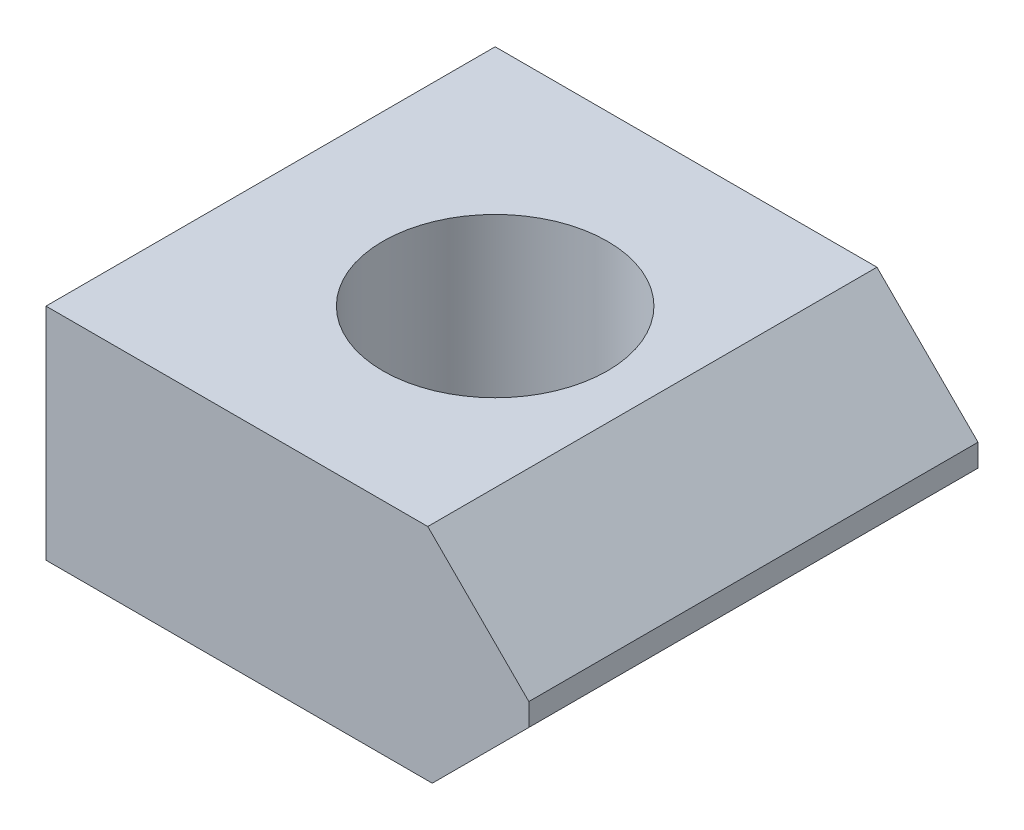
ISO-10303-21;
HEADER;
FILE_DESCRIPTION(('STEP AP214'),'2;1');
FILE_NAME('part.step','',(''),(''),'','','');
FILE_SCHEMA(('AUTOMOTIVE_DESIGN { 1 0 10303 214 1 1 1 1 }'));
ENDSEC;
DATA;
#1=APPLICATION_CONTEXT('core data for automotive mechanical design processes');
#2=APPLICATION_PROTOCOL_DEFINITION('international standard','automotive_design',2000,#1);
#3=PRODUCT_CONTEXT('',#1,'mechanical');
#4=PRODUCT('Part','Part','',(#3));
#5=PRODUCT_RELATED_PRODUCT_CATEGORY('part','',(#4));
#6=PRODUCT_DEFINITION_FORMATION('','',#4);
#7=PRODUCT_DEFINITION_CONTEXT('part definition',#1,'design');
#8=PRODUCT_DEFINITION('design','',#6,#7);
#9=PRODUCT_DEFINITION_SHAPE('','',#8);
#10=(LENGTH_UNIT() NAMED_UNIT(*) SI_UNIT(.MILLI.,.METRE.));
#11=(NAMED_UNIT(*) PLANE_ANGLE_UNIT() SI_UNIT($,.RADIAN.));
#12=(NAMED_UNIT(*) SI_UNIT($,.STERADIAN.) SOLID_ANGLE_UNIT());
#13=UNCERTAINTY_MEASURE_WITH_UNIT(LENGTH_MEASURE(1.E-05),#10,'distance_accuracy_value','');
#14=(GEOMETRIC_REPRESENTATION_CONTEXT(3) GLOBAL_UNCERTAINTY_ASSIGNED_CONTEXT((#13)) GLOBAL_UNIT_ASSIGNED_CONTEXT((#10,
#11,#12)) REPRESENTATION_CONTEXT('',''));
#15=CARTESIAN_POINT('',(0.,0.,0.));
#16=DIRECTION('',(0.,0.,1.));
#17=DIRECTION('',(1.,0.,0.));
#18=AXIS2_PLACEMENT_3D('',#15,#16,#17);
#19=CARTESIAN_POINT('',(17.,15.5,0.));
#20=DIRECTION('',(0.707106781186548,0.707106781186548,0.));
#21=DIRECTION('',(-0.707106781186548,0.707106781186548,0.));
#22=AXIS2_PLACEMENT_3D('',#19,#20,#21);
#23=PLANE('',#22);
#24=DIRECTION('',(0.,0.,-1.));
#25=VECTOR('',#24,1.);
#26=CARTESIAN_POINT('',(21.5,11.,20.));
#27=LINE('',#26,#25);
#28=CARTESIAN_POINT('',(21.5,11.,-20.));
#29=VERTEX_POINT('',#28);
#30=CARTESIAN_POINT('',(21.5,11.,20.));
#31=VERTEX_POINT('',#30);
#32=EDGE_CURVE('E73',#29,#31,#27,.F.);
#33=ORIENTED_EDGE('',*,*,#32,.F.);
#34=DIRECTION('',(0.707106781186547,-0.707106781186547,0.));
#35=VECTOR('',#34,1.);
#36=CARTESIAN_POINT('',(12.5,20.,-20.));
#37=LINE('',#36,#35);
#38=CARTESIAN_POINT('',(12.5,20.,-20.));
#39=VERTEX_POINT('',#38);
#40=EDGE_CURVE('E104',#39,#29,#37,.T.);
#41=ORIENTED_EDGE('',*,*,#40,.F.);
#42=DIRECTION('',(0.,0.,1.));
#43=VECTOR('',#42,1.);
#44=CARTESIAN_POINT('',(12.5,20.,0.));
#45=LINE('',#44,#43);
#46=CARTESIAN_POINT('',(12.5,20.,20.));
#47=VERTEX_POINT('',#46);
#48=EDGE_CURVE('E81',#47,#39,#45,.F.);
#49=ORIENTED_EDGE('',*,*,#48,.F.);
#50=DIRECTION('',(-0.707106781186547,0.707106781186547,0.));
#51=VECTOR('',#50,1.);
#52=CARTESIAN_POINT('',(21.5,11.,20.));
#53=LINE('',#52,#51);
#54=EDGE_CURVE('E66',#31,#47,#53,.T.);
#55=ORIENTED_EDGE('',*,*,#54,.F.);
#56=EDGE_LOOP('',(#33,#41,#49,#55));
#57=FACE_BOUND('',#56,.T.);
#58=ADVANCED_FACE('F17',(#57),#23,.T.);
#59=CARTESIAN_POINT('',(21.5,0.,20.));
#60=DIRECTION('',(1.,0.,0.));
#61=DIRECTION('',(0.,0.,-1.));
#62=AXIS2_PLACEMENT_3D('',#59,#60,#61);
#63=PLANE('',#62);
#64=DIRECTION('',(0.,1.,0.));
#65=VECTOR('',#64,1.);
#66=CARTESIAN_POINT('',(21.5,0.,-20.));
#67=LINE('',#66,#65);
#68=CARTESIAN_POINT('',(21.5,9.,-20.));
#69=VERTEX_POINT('',#68);
#70=EDGE_CURVE('E78',#29,#69,#67,.F.);
#71=ORIENTED_EDGE('',*,*,#70,.F.);
#72=ORIENTED_EDGE('',*,*,#32,.T.);
#73=DIRECTION('',(0.,1.,0.));
#74=VECTOR('',#73,1.);
#75=CARTESIAN_POINT('',(21.5,0.,20.));
#76=LINE('',#75,#74);
#77=CARTESIAN_POINT('',(21.5,9.,20.));
#78=VERTEX_POINT('',#77);
#79=EDGE_CURVE('E76',#78,#31,#76,.T.);
#80=ORIENTED_EDGE('',*,*,#79,.F.);
#81=DIRECTION('',(0.,0.,1.));
#82=VECTOR('',#81,1.);
#83=CARTESIAN_POINT('',(21.5,9.,0.));
#84=LINE('',#83,#82);
#85=EDGE_CURVE('E114',#69,#78,#84,.T.);
#86=ORIENTED_EDGE('',*,*,#85,.F.);
#87=EDGE_LOOP('',(#71,#72,#80,#86));
#88=FACE_BOUND('',#87,.T.);
#89=ADVANCED_FACE('F74',(#88),#63,.T.);
#90=CARTESIAN_POINT('',(0.,20.,0.));
#91=DIRECTION('',(0.,1.,0.));
#92=DIRECTION('',(0.,0.,1.));
#93=AXIS2_PLACEMENT_3D('',#90,#91,#92);
#94=PLANE('',#93);
#95=CARTESIAN_POINT('',(-1.5,20.,0.));
#96=DIRECTION('',(0.,1.,0.));
#97=DIRECTION('',(0.,0.,1.));
#98=AXIS2_PLACEMENT_3D('',#95,#96,#97);
#99=CIRCLE('',#98,10.);
#100=CARTESIAN_POINT('',(-1.5,20.,10.));
#101=VERTEX_POINT('',#100);
#102=EDGE_CURVE('E20',#101,#101,#99,.F.);
#103=ORIENTED_EDGE('',*,*,#102,.T.);
#104=EDGE_LOOP('',(#103));
#105=FACE_BOUND('',#104,.T.);
#106=DIRECTION('',(1.,0.,0.));
#107=VECTOR('',#106,1.);
#108=CARTESIAN_POINT('',(-21.5,20.,20.));
#109=LINE('',#108,#107);
#110=CARTESIAN_POINT('',(-21.5,20.,20.));
#111=VERTEX_POINT('',#110);
#112=EDGE_CURVE('E89',#47,#111,#109,.F.);
#113=ORIENTED_EDGE('',*,*,#112,.F.);
#114=ORIENTED_EDGE('',*,*,#48,.T.);
#115=DIRECTION('',(-1.,0.,0.));
#116=VECTOR('',#115,1.);
#117=CARTESIAN_POINT('',(21.5,20.,-20.));
#118=LINE('',#117,#116);
#119=CARTESIAN_POINT('',(-21.5,20.,-20.));
#120=VERTEX_POINT('',#119);
#121=EDGE_CURVE('E101',#120,#39,#118,.F.);
#122=ORIENTED_EDGE('',*,*,#121,.F.);
#123=DIRECTION('',(0.,0.,1.));
#124=VECTOR('',#123,1.);
#125=CARTESIAN_POINT('',(-21.5,20.,-20.));
#126=LINE('',#125,#124);
#127=EDGE_CURVE('E86',#111,#120,#126,.F.);
#128=ORIENTED_EDGE('',*,*,#127,.F.);
#129=EDGE_LOOP('',(#113,#114,#122,#128));
#130=FACE_BOUND('',#129,.T.);
#131=ADVANCED_FACE('F99',(#105,#130),#94,.T.);
#132=CARTESIAN_POINT('',(-21.5,0.,-20.));
#133=DIRECTION('',(-1.,0.,0.));
#134=DIRECTION('',(0.,0.,1.));
#135=AXIS2_PLACEMENT_3D('',#132,#133,#134);
#136=PLANE('',#135);
#137=DIRECTION('',(0.,1.,0.));
#138=VECTOR('',#137,1.);
#139=CARTESIAN_POINT('',(-21.5,0.,-20.));
#140=LINE('',#139,#138);
#141=CARTESIAN_POINT('',(-21.5,0.4,-20.));
#142=VERTEX_POINT('',#141);
#143=EDGE_CURVE('E106',#142,#120,#140,.T.);
#144=ORIENTED_EDGE('',*,*,#143,.F.);
#145=DIRECTION('',(0.,0.,1.));
#146=VECTOR('',#145,1.);
#147=CARTESIAN_POINT('',(-21.5,0.4,20.));
#148=LINE('',#147,#146);
#149=CARTESIAN_POINT('',(-21.5,0.4,20.));
#150=VERTEX_POINT('',#149);
#151=EDGE_CURVE('E123',#142,#150,#148,.T.);
#152=ORIENTED_EDGE('',*,*,#151,.T.);
#153=DIRECTION('',(0.,1.,0.));
#154=VECTOR('',#153,1.);
#155=CARTESIAN_POINT('',(-21.5,0.,20.));
#156=LINE('',#155,#154);
#157=EDGE_CURVE('E91',#111,#150,#156,.F.);
#158=ORIENTED_EDGE('',*,*,#157,.F.);
#159=ORIENTED_EDGE('',*,*,#127,.T.);
#160=EDGE_LOOP('',(#144,#152,#158,#159));
#161=FACE_BOUND('',#160,.T.);
#162=ADVANCED_FACE('F127',(#161),#136,.T.);
#163=CARTESIAN_POINT('',(-21.5,0.,20.));
#164=DIRECTION('',(0.,0.,1.));
#165=DIRECTION('',(1.,0.,0.));
#166=AXIS2_PLACEMENT_3D('',#163,#164,#165);
#167=PLANE('',#166);
#168=ORIENTED_EDGE('',*,*,#157,.T.);
#169=DIRECTION('',(1.,0.,0.));
#170=VECTOR('',#169,1.);
#171=CARTESIAN_POINT('',(14.2117052527,0.4,20.));
#172=LINE('',#171,#170);
#173=CARTESIAN_POINT('',(12.9,0.4,20.));
#174=VERTEX_POINT('',#173);
#175=EDGE_CURVE('E117',#150,#174,#172,.T.);
#176=ORIENTED_EDGE('',*,*,#175,.T.);
#177=DIRECTION('',(0.707106781186548,0.707106781186548,0.));
#178=VECTOR('',#177,1.);
#179=CARTESIAN_POINT('',(17.,4.5,20.));
#180=LINE('',#179,#178);
#181=EDGE_CURVE('E85',#78,#174,#180,.F.);
#182=ORIENTED_EDGE('',*,*,#181,.F.);
#183=ORIENTED_EDGE('',*,*,#79,.T.);
#184=ORIENTED_EDGE('',*,*,#54,.T.);
#185=ORIENTED_EDGE('',*,*,#112,.T.);
#186=EDGE_LOOP('',(#168,#176,#182,#183,#184,#185));
#187=FACE_BOUND('',#186,.T.);
#188=ADVANCED_FACE('F83',(#187),#167,.T.);
#189=CARTESIAN_POINT('',(17.,4.5,0.));
#190=DIRECTION('',(0.707106781186548,-0.707106781186548,0.));
#191=DIRECTION('',(0.707106781186548,0.707106781186548,0.));
#192=AXIS2_PLACEMENT_3D('',#189,#190,#191);
#193=PLANE('',#192);
#194=ORIENTED_EDGE('',*,*,#181,.T.);
#195=DIRECTION('',(0.,0.,1.));
#196=VECTOR('',#195,1.);
#197=CARTESIAN_POINT('',(12.9,0.4,20.));
#198=LINE('',#197,#196);
#199=CARTESIAN_POINT('',(12.9,0.4,-20.));
#200=VERTEX_POINT('',#199);
#201=EDGE_CURVE('E125',#174,#200,#198,.F.);
#202=ORIENTED_EDGE('',*,*,#201,.T.);
#203=DIRECTION('',(-0.707106781186548,-0.707106781186548,0.));
#204=VECTOR('',#203,1.);
#205=CARTESIAN_POINT('',(21.5,9.,-20.));
#206=LINE('',#205,#204);
#207=EDGE_CURVE('E34',#69,#200,#206,.T.);
#208=ORIENTED_EDGE('',*,*,#207,.F.);
#209=ORIENTED_EDGE('',*,*,#85,.T.);
#210=EDGE_LOOP('',(#194,#202,#208,#209));
#211=FACE_BOUND('',#210,.T.);
#212=ADVANCED_FACE('F133',(#211),#193,.T.);
#213=CARTESIAN_POINT('',(21.5,0.,-20.));
#214=DIRECTION('',(0.,0.,-1.));
#215=DIRECTION('',(-1.,0.,0.));
#216=AXIS2_PLACEMENT_3D('',#213,#214,#215);
#217=PLANE('',#216);
#218=ORIENTED_EDGE('',*,*,#207,.T.);
#219=DIRECTION('',(1.,0.,0.));
#220=VECTOR('',#219,1.);
#221=CARTESIAN_POINT('',(14.2117052527,0.4,-20.));
#222=LINE('',#221,#220);
#223=EDGE_CURVE('E26',#200,#142,#222,.F.);
#224=ORIENTED_EDGE('',*,*,#223,.T.);
#225=ORIENTED_EDGE('',*,*,#143,.T.);
#226=ORIENTED_EDGE('',*,*,#121,.T.);
#227=ORIENTED_EDGE('',*,*,#40,.T.);
#228=ORIENTED_EDGE('',*,*,#70,.T.);
#229=EDGE_LOOP('',(#218,#224,#225,#226,#227,#228));
#230=FACE_BOUND('',#229,.T.);
#231=ADVANCED_FACE('F103',(#230),#217,.T.);
#232=CARTESIAN_POINT('',(-1.5,20.,0.));
#233=DIRECTION('',(0.,1.,0.));
#234=DIRECTION('',(0.,0.,1.));
#235=AXIS2_PLACEMENT_3D('',#232,#233,#234);
#236=CYLINDRICAL_SURFACE('',#235,10.);
#237=ORIENTED_EDGE('',*,*,#102,.F.);
#238=EDGE_LOOP('',(#237));
#239=FACE_BOUND('',#238,.T.);
#240=CARTESIAN_POINT('',(-1.5,0.400000000000001,0.));
#241=DIRECTION('',(0.,1.,0.));
#242=DIRECTION('',(0.,0.,1.));
#243=AXIS2_PLACEMENT_3D('',#240,#241,#242);
#244=CIRCLE('',#243,10.);
#245=CARTESIAN_POINT('',(-1.5,0.400000000000001,10.));
#246=VERTEX_POINT('',#245);
#247=EDGE_CURVE('E11',#246,#246,#244,.F.);
#248=ORIENTED_EDGE('',*,*,#247,.T.);
#249=EDGE_LOOP('',(#248));
#250=FACE_BOUND('',#249,.T.);
#251=ADVANCED_FACE('F141',(#239,#250),#236,.F.);
#252=CARTESIAN_POINT('',(14.2117052527,0.4,20.));
#253=DIRECTION('',(0.,1.,0.));
#254=DIRECTION('',(0.,0.,1.));
#255=AXIS2_PLACEMENT_3D('',#252,#253,#254);
#256=PLANE('',#255);
#257=ORIENTED_EDGE('',*,*,#247,.F.);
#258=EDGE_LOOP('',(#257));
#259=FACE_BOUND('',#258,.T.);
#260=ORIENTED_EDGE('',*,*,#201,.F.);
#261=ORIENTED_EDGE('',*,*,#175,.F.);
#262=ORIENTED_EDGE('',*,*,#151,.F.);
#263=ORIENTED_EDGE('',*,*,#223,.F.);
#264=EDGE_LOOP('',(#260,#261,#262,#263));
#265=FACE_BOUND('',#264,.T.);
#266=ADVANCED_FACE('F122',(#259,#265),#256,.F.);
#267=CLOSED_SHELL('',(#58,#89,#131,#162,#188,#212,#231,#251,#266));
#268=MANIFOLD_SOLID_BREP('B1',#267);
#269=ADVANCED_BREP_SHAPE_REPRESENTATION('',(#18,#268),#14);
#270=SHAPE_DEFINITION_REPRESENTATION(#9,#269);
ENDSEC;
END-ISO-10303-21;
